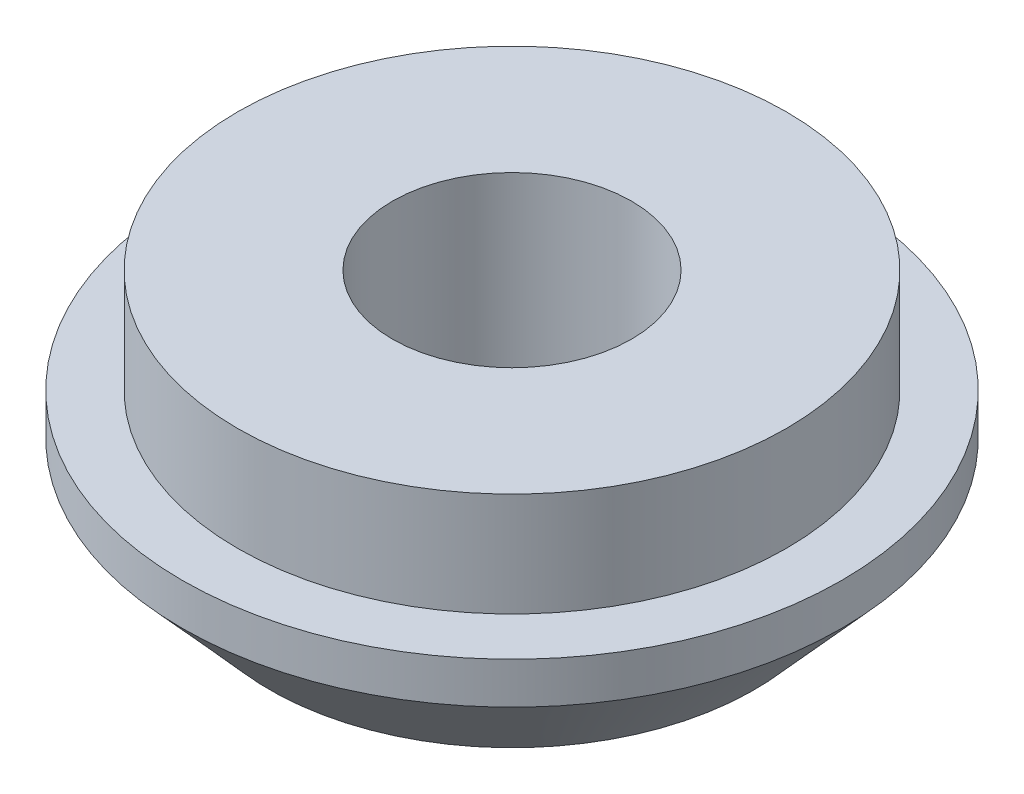
ISO-10303-21;
HEADER;
FILE_DESCRIPTION(('STEP AP214'),'2;1');
FILE_NAME('part.step','',(''),(''),'','','');
FILE_SCHEMA(('AUTOMOTIVE_DESIGN { 1 0 10303 214 1 1 1 1 }'));
ENDSEC;
DATA;
#1=APPLICATION_CONTEXT('core data for automotive mechanical design processes');
#2=APPLICATION_PROTOCOL_DEFINITION('international standard','automotive_design',2000,#1);
#3=PRODUCT_CONTEXT('',#1,'mechanical');
#4=PRODUCT('Part','Part','',(#3));
#5=PRODUCT_RELATED_PRODUCT_CATEGORY('part','',(#4));
#6=PRODUCT_DEFINITION_FORMATION('','',#4);
#7=PRODUCT_DEFINITION_CONTEXT('part definition',#1,'design');
#8=PRODUCT_DEFINITION('design','',#6,#7);
#9=PRODUCT_DEFINITION_SHAPE('','',#8);
#10=(LENGTH_UNIT() NAMED_UNIT(*) SI_UNIT(.MILLI.,.METRE.));
#11=(NAMED_UNIT(*) PLANE_ANGLE_UNIT() SI_UNIT($,.RADIAN.));
#12=(NAMED_UNIT(*) SI_UNIT($,.STERADIAN.) SOLID_ANGLE_UNIT());
#13=UNCERTAINTY_MEASURE_WITH_UNIT(LENGTH_MEASURE(1.E-05),#10,'distance_accuracy_value','');
#14=(GEOMETRIC_REPRESENTATION_CONTEXT(3) GLOBAL_UNCERTAINTY_ASSIGNED_CONTEXT((#13)) GLOBAL_UNIT_ASSIGNED_CONTEXT((#10,
#11,#12)) REPRESENTATION_CONTEXT('',''));
#15=CARTESIAN_POINT('',(0.,0.,0.));
#16=DIRECTION('',(0.,0.,1.));
#17=DIRECTION('',(1.,0.,0.));
#18=AXIS2_PLACEMENT_3D('',#15,#16,#17);
#19=CARTESIAN_POINT('',(-4.44089209850063E-13,6.99999999999973,-3.33066907387547E-13));
#20=DIRECTION('',(0.,-0.999999999999999,0.));
#21=DIRECTION('',(0.,0.,-1.));
#22=AXIS2_PLACEMENT_3D('',#19,#20,#21);
#23=CYLINDRICAL_SURFACE('',#22,9.525);
#24=CARTESIAN_POINT('',(-8.88178419700125E-13,4.00000000000045,0.));
#25=DIRECTION('',(0.,0.999999999999999,0.));
#26=DIRECTION('',(0.,0.,1.));
#27=AXIS2_PLACEMENT_3D('',#24,#25,#26);
#28=CIRCLE('',#27,9.525);
#29=CARTESIAN_POINT('',(-8.86327816695953E-13,4.00000000000045,9.52499999999996));
#30=VERTEX_POINT('',#29);
#31=EDGE_CURVE('E45',#30,#30,#28,.T.);
#32=ORIENTED_EDGE('',*,*,#31,.F.);
#33=EDGE_LOOP('',(#32));
#34=FACE_BOUND('',#33,.T.);
#35=CARTESIAN_POINT('',(8.88178419700125E-13,2.79999999999997,-2.22044604925031E-13));
#36=DIRECTION('',(0.,-0.999999999999999,0.));
#37=DIRECTION('',(0.,0.,-1.));
#38=AXIS2_PLACEMENT_3D('',#35,#36,#37);
#39=CIRCLE('',#38,9.525);
#40=CARTESIAN_POINT('',(8.86327816695953E-13,2.79999999999997,-9.52500000000024));
#41=VERTEX_POINT('',#40);
#42=EDGE_CURVE('E59',#41,#41,#39,.T.);
#43=ORIENTED_EDGE('',*,*,#42,.F.);
#44=EDGE_LOOP('',(#43));
#45=FACE_BOUND('',#44,.T.);
#46=ADVANCED_FACE('F42',(#34,#45),#23,.T.);
#47=CARTESIAN_POINT('',(0.,0.,0.));
#48=DIRECTION('',(0.,0.999999999999999,0.));
#49=DIRECTION('',(0.,0.,1.));
#50=AXIS2_PLACEMENT_3D('',#47,#48,#49);
#51=PLANE('',#50);
#52=CARTESIAN_POINT('',(0.,0.,0.));
#53=DIRECTION('',(0.,-0.999999999999999,0.));
#54=DIRECTION('',(0.,0.,-1.));
#55=AXIS2_PLACEMENT_3D('',#52,#53,#54);
#56=CIRCLE('',#55,3.45439999999999);
#57=CARTESIAN_POINT('',(0.,0.,-3.45439999999999));
#58=VERTEX_POINT('',#57);
#59=EDGE_CURVE('E49',#58,#58,#56,.T.);
#60=ORIENTED_EDGE('',*,*,#59,.F.);
#61=EDGE_LOOP('',(#60));
#62=FACE_BOUND('',#61,.T.);
#63=CARTESIAN_POINT('',(0.,0.,0.));
#64=DIRECTION('',(0.,-0.999999999999999,0.));
#65=DIRECTION('',(0.,0.,-1.));
#66=AXIS2_PLACEMENT_3D('',#63,#64,#65);
#67=CIRCLE('',#66,7.);
#68=CARTESIAN_POINT('',(0.,0.,-7.00000000000001));
#69=VERTEX_POINT('',#68);
#70=EDGE_CURVE('E64',#69,#69,#67,.T.);
#71=ORIENTED_EDGE('',*,*,#70,.T.);
#72=EDGE_LOOP('',(#71));
#73=FACE_BOUND('',#72,.T.);
#74=ADVANCED_FACE('F68',(#62,#73),#51,.F.);
#75=CARTESIAN_POINT('',(-4.44089209850063E-13,6.99999999999973,-3.33066907387547E-13));
#76=DIRECTION('',(0.,0.999999999999999,0.));
#77=DIRECTION('',(0.,0.,1.));
#78=AXIS2_PLACEMENT_3D('',#75,#76,#77);
#79=PLANE('',#78);
#80=CARTESIAN_POINT('',(-4.44089209850063E-13,6.99999999999973,-3.33066907387547E-13));
#81=DIRECTION('',(0.,-0.999999999999999,0.));
#82=DIRECTION('',(0.,0.,-1.));
#83=AXIS2_PLACEMENT_3D('',#80,#81,#82);
#84=CIRCLE('',#83,3.4544);
#85=CARTESIAN_POINT('',(-4.44760361872909E-13,6.99999999999973,-3.45440000000034));
#86=VERTEX_POINT('',#85);
#87=EDGE_CURVE('E11',#86,#86,#84,.T.);
#88=ORIENTED_EDGE('',*,*,#87,.T.);
#89=EDGE_LOOP('',(#88));
#90=FACE_BOUND('',#89,.T.);
#91=CARTESIAN_POINT('',(-4.44089209850063E-13,6.99999999999973,-3.33066907387547E-13));
#92=DIRECTION('',(0.,0.999999999999999,0.));
#93=DIRECTION('',(0.,0.,1.));
#94=AXIS2_PLACEMENT_3D('',#91,#92,#93);
#95=CIRCLE('',#94,7.925);
#96=CARTESIAN_POINT('',(-4.42549469292786E-13,6.99999999999973,7.92499999999968));
#97=VERTEX_POINT('',#96);
#98=EDGE_CURVE('E55',#97,#97,#95,.T.);
#99=ORIENTED_EDGE('',*,*,#98,.T.);
#100=EDGE_LOOP('',(#99));
#101=FACE_BOUND('',#100,.T.);
#102=ADVANCED_FACE('F85',(#90,#101),#79,.T.);
#103=CARTESIAN_POINT('',(0.,0.,0.));
#104=DIRECTION('',(0.,-0.999999999999999,0.));
#105=DIRECTION('',(0.,0.,-1.));
#106=AXIS2_PLACEMENT_3D('',#103,#104,#105);
#107=CYLINDRICAL_SURFACE('',#106,3.45439999999999);
#108=ORIENTED_EDGE('',*,*,#87,.F.);
#109=EDGE_LOOP('',(#108));
#110=FACE_BOUND('',#109,.T.);
#111=ORIENTED_EDGE('',*,*,#59,.T.);
#112=EDGE_LOOP('',(#111));
#113=FACE_BOUND('',#112,.T.);
#114=ADVANCED_FACE('F93',(#110,#113),#107,.F.);
#115=CARTESIAN_POINT('',(-8.88178419700125E-13,4.00000000000045,0.));
#116=DIRECTION('',(0.,0.999999999999999,0.));
#117=DIRECTION('',(0.,0.,1.));
#118=AXIS2_PLACEMENT_3D('',#115,#116,#117);
#119=PLANE('',#118);
#120=CARTESIAN_POINT('',(-8.88178419700125E-13,4.00000000000045,0.));
#121=DIRECTION('',(0.,0.999999999999999,0.));
#122=DIRECTION('',(0.,0.,1.));
#123=AXIS2_PLACEMENT_3D('',#120,#121,#122);
#124=CIRCLE('',#123,7.925);
#125=CARTESIAN_POINT('',(-8.86638679142848E-13,4.00000000000045,7.92499999999996));
#126=VERTEX_POINT('',#125);
#127=EDGE_CURVE('E58',#126,#126,#124,.T.);
#128=ORIENTED_EDGE('',*,*,#127,.F.);
#129=EDGE_LOOP('',(#128));
#130=FACE_BOUND('',#129,.T.);
#131=ORIENTED_EDGE('',*,*,#31,.T.);
#132=EDGE_LOOP('',(#131));
#133=FACE_BOUND('',#132,.T.);
#134=ADVANCED_FACE('F78',(#130,#133),#119,.T.);
#135=CARTESIAN_POINT('',(-8.88178419700125E-13,4.00000000000045,0.));
#136=DIRECTION('',(0.,0.999999999999999,0.));
#137=DIRECTION('',(0.,0.,1.));
#138=AXIS2_PLACEMENT_3D('',#135,#136,#137);
#139=CYLINDRICAL_SURFACE('',#138,7.925);
#140=ORIENTED_EDGE('',*,*,#127,.T.);
#141=EDGE_LOOP('',(#140));
#142=FACE_BOUND('',#141,.T.);
#143=ORIENTED_EDGE('',*,*,#98,.F.);
#144=EDGE_LOOP('',(#143));
#145=FACE_BOUND('',#144,.T.);
#146=ADVANCED_FACE('F72',(#142,#145),#139,.T.);
#147=CARTESIAN_POINT('',(0.,0.,0.));
#148=DIRECTION('',(0.,0.999999999999999,0.));
#149=DIRECTION('',(0.,0.,1.));
#150=AXIS2_PLACEMENT_3D('',#147,#148,#149);
#151=CONICAL_SURFACE('',#150,7.,0.733800808712211);
#152=ORIENTED_EDGE('',*,*,#42,.T.);
#153=EDGE_LOOP('',(#152));
#154=FACE_BOUND('',#153,.T.);
#155=ORIENTED_EDGE('',*,*,#70,.F.);
#156=EDGE_LOOP('',(#155));
#157=FACE_BOUND('',#156,.T.);
#158=ADVANCED_FACE('F70',(#154,#157),#151,.T.);
#159=CLOSED_SHELL('',(#46,#74,#102,#114,#134,#146,#158));
#160=MANIFOLD_SOLID_BREP('B2',#159);
#161=ADVANCED_BREP_SHAPE_REPRESENTATION('',(#18,#160),#14);
#162=SHAPE_DEFINITION_REPRESENTATION(#9,#161);
ENDSEC;
END-ISO-10303-21;
